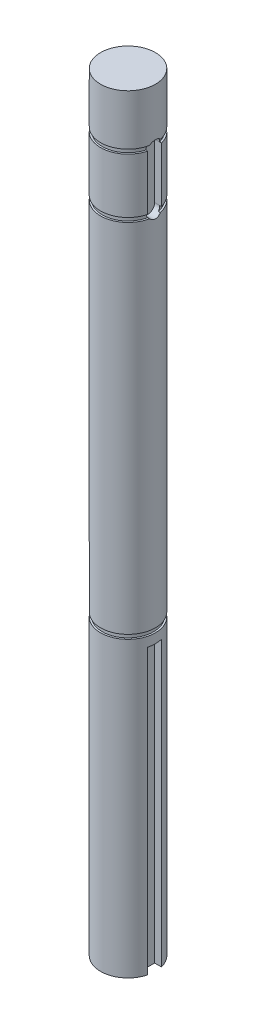
ISO-10303-21;
HEADER;
FILE_DESCRIPTION(('STEP AP214'),'2;1');
FILE_NAME('part.step','',(''),(''),'','','');
FILE_SCHEMA(('AUTOMOTIVE_DESIGN { 1 0 10303 214 1 1 1 1 }'));
ENDSEC;
DATA;
#1=APPLICATION_CONTEXT('core data for automotive mechanical design processes');
#2=APPLICATION_PROTOCOL_DEFINITION('international standard','automotive_design',2000,#1);
#3=PRODUCT_CONTEXT('',#1,'mechanical');
#4=PRODUCT('Part','Part','',(#3));
#5=PRODUCT_RELATED_PRODUCT_CATEGORY('part','',(#4));
#6=PRODUCT_DEFINITION_FORMATION('','',#4);
#7=PRODUCT_DEFINITION_CONTEXT('part definition',#1,'design');
#8=PRODUCT_DEFINITION('design','',#6,#7);
#9=PRODUCT_DEFINITION_SHAPE('','',#8);
#10=(LENGTH_UNIT() NAMED_UNIT(*) SI_UNIT(.MILLI.,.METRE.));
#11=(NAMED_UNIT(*) PLANE_ANGLE_UNIT() SI_UNIT($,.RADIAN.));
#12=(NAMED_UNIT(*) SI_UNIT($,.STERADIAN.) SOLID_ANGLE_UNIT());
#13=UNCERTAINTY_MEASURE_WITH_UNIT(LENGTH_MEASURE(1.E-05),#10,'distance_accuracy_value','');
#14=(GEOMETRIC_REPRESENTATION_CONTEXT(3) GLOBAL_UNCERTAINTY_ASSIGNED_CONTEXT((#13)) GLOBAL_UNIT_ASSIGNED_CONTEXT((#10,
#11,#12)) REPRESENTATION_CONTEXT('',''));
#15=CARTESIAN_POINT('',(0.,0.,0.));
#16=DIRECTION('',(0.,0.,1.));
#17=DIRECTION('',(1.,0.,0.));
#18=AXIS2_PLACEMENT_3D('',#15,#16,#17);
#19=CARTESIAN_POINT('',(0.,177.8,0.));
#20=DIRECTION('',(0.,-1.,0.));
#21=DIRECTION('',(0.,0.,-1.));
#22=AXIS2_PLACEMENT_3D('',#19,#20,#21);
#23=CYLINDRICAL_SURFACE('',#22,6.35);
#24=DIRECTION('',(0.,-1.,0.));
#25=VECTOR('',#24,1.);
#26=CARTESIAN_POINT('',(6.14836106210428,177.8,-1.5875));
#27=LINE('',#26,#25);
#28=CARTESIAN_POINT('',(6.14836106210428,152.4,-1.5875));
#29=VERTEX_POINT('',#28);
#30=CARTESIAN_POINT('',(6.14836106210428,165.1,-1.5875));
#31=VERTEX_POINT('',#30);
#32=EDGE_CURVE('E359',#29,#31,#27,.F.);
#33=ORIENTED_EDGE('',*,*,#32,.F.);
#34=CARTESIAN_POINT('',(0.,152.4,0.));
#35=DIRECTION('',(0.,1.,0.));
#36=DIRECTION('',(0.,0.,1.));
#37=AXIS2_PLACEMENT_3D('',#34,#35,#36);
#38=CIRCLE('',#37,6.35);
#39=CARTESIAN_POINT('',(6.14836106210428,152.4,1.5875));
#40=VERTEX_POINT('',#39);
#41=EDGE_CURVE('E324',#29,#40,#38,.T.);
#42=ORIENTED_EDGE('',*,*,#41,.T.);
#43=DIRECTION('',(0.,-1.,0.));
#44=VECTOR('',#43,1.);
#45=CARTESIAN_POINT('',(6.14836106210427,177.8,1.5875));
#46=LINE('',#45,#44);
#47=CARTESIAN_POINT('',(6.14836106210428,165.1,1.5875));
#48=VERTEX_POINT('',#47);
#49=EDGE_CURVE('E361',#40,#48,#46,.F.);
#50=ORIENTED_EDGE('',*,*,#49,.T.);
#51=CARTESIAN_POINT('',(0.,165.1,0.));
#52=DIRECTION('',(0.,-1.,0.));
#53=DIRECTION('',(0.,0.,-1.));
#54=AXIS2_PLACEMENT_3D('',#51,#52,#53);
#55=CIRCLE('',#54,6.35);
#56=EDGE_CURVE('E355',#48,#31,#55,.T.);
#57=ORIENTED_EDGE('',*,*,#56,.T.);
#58=EDGE_LOOP('',(#33,#42,#50,#57));
#59=FACE_BOUND('',#58,.T.);
#60=ADVANCED_FACE('F32',(#59),#23,.T.);
#61=CARTESIAN_POINT('',(0.,165.1,44.9225171601781));
#62=DIRECTION('',(0.,-1.,0.));
#63=DIRECTION('',(0.,0.,-1.));
#64=AXIS2_PLACEMENT_3D('',#61,#62,#63);
#65=PLANE('',#64);
#66=DIRECTION('',(1.,0.,0.));
#67=VECTOR('',#66,1.);
#68=CARTESIAN_POINT('',(4.572,165.1,-1.5875));
#69=LINE('',#68,#67);
#70=CARTESIAN_POINT('',(5.72767184028555,165.1,-1.5875));
#71=VERTEX_POINT('',#70);
#72=EDGE_CURVE('E176',#71,#31,#69,.T.);
#73=ORIENTED_EDGE('',*,*,#72,.T.);
#74=ORIENTED_EDGE('',*,*,#56,.F.);
#75=DIRECTION('',(1.,0.,0.));
#76=VECTOR('',#75,1.);
#77=CARTESIAN_POINT('',(4.572,165.1,1.5875));
#78=LINE('',#77,#76);
#79=CARTESIAN_POINT('',(5.72767184028555,165.1,1.5875));
#80=VERTEX_POINT('',#79);
#81=EDGE_CURVE('E172',#80,#48,#78,.T.);
#82=ORIENTED_EDGE('',*,*,#81,.F.);
#83=CARTESIAN_POINT('',(0.,165.1,0.));
#84=DIRECTION('',(0.,1.,0.));
#85=DIRECTION('',(0.,0.,1.));
#86=AXIS2_PLACEMENT_3D('',#83,#84,#85);
#87=CIRCLE('',#86,5.9436);
#88=EDGE_CURVE('E327',#71,#80,#87,.T.);
#89=ORIENTED_EDGE('',*,*,#88,.F.);
#90=EDGE_LOOP('',(#73,#74,#82,#89));
#91=FACE_BOUND('',#90,.T.);
#92=ADVANCED_FACE('F273',(#91),#65,.F.);
#93=CARTESIAN_POINT('',(0.,166.0906,44.9225171601781));
#94=DIRECTION('',(0.,1.,0.));
#95=DIRECTION('',(0.,0.,1.));
#96=AXIS2_PLACEMENT_3D('',#93,#94,#95);
#97=PLANE('',#96);
#98=CARTESIAN_POINT('',(0.,166.0906,0.));
#99=DIRECTION('',(0.,1.,0.));
#100=DIRECTION('',(0.,0.,1.));
#101=AXIS2_PLACEMENT_3D('',#98,#99,#100);
#102=CIRCLE('',#101,5.9436);
#103=CARTESIAN_POINT('',(5.81270273366874,166.0906,-1.24051114061905));
#104=VERTEX_POINT('',#103);
#105=CARTESIAN_POINT('',(5.81270273366874,166.0906,1.24051114061905));
#106=VERTEX_POINT('',#105);
#107=EDGE_CURVE('E323',#104,#106,#102,.T.);
#108=ORIENTED_EDGE('',*,*,#107,.T.);
#109=DIRECTION('',(1.,0.,0.));
#110=VECTOR('',#109,1.);
#111=CARTESIAN_POINT('',(4.572,166.0906,1.24051114061905));
#112=LINE('',#111,#110);
#113=CARTESIAN_POINT('',(6.22765060917839,166.0906,1.24051114061905));
#114=VERTEX_POINT('',#113);
#115=EDGE_CURVE('E259',#106,#114,#112,.T.);
#116=ORIENTED_EDGE('',*,*,#115,.T.);
#117=CARTESIAN_POINT('',(0.,166.0906,0.));
#118=DIRECTION('',(0.,1.,0.));
#119=DIRECTION('',(0.,0.,1.));
#120=AXIS2_PLACEMENT_3D('',#117,#118,#119);
#121=CIRCLE('',#120,6.35);
#122=CARTESIAN_POINT('',(6.22765060917839,166.0906,-1.24051114061905));
#123=VERTEX_POINT('',#122);
#124=EDGE_CURVE('E349',#123,#114,#121,.T.);
#125=ORIENTED_EDGE('',*,*,#124,.F.);
#126=DIRECTION('',(1.,0.,0.));
#127=VECTOR('',#126,1.);
#128=CARTESIAN_POINT('',(4.572,166.0906,-1.24051114061905));
#129=LINE('',#128,#127);
#130=EDGE_CURVE('E374',#123,#104,#129,.F.);
#131=ORIENTED_EDGE('',*,*,#130,.T.);
#132=EDGE_LOOP('',(#108,#116,#125,#131));
#133=FACE_BOUND('',#132,.T.);
#134=ADVANCED_FACE('F271',(#133),#97,.F.);
#135=CARTESIAN_POINT('',(0.,174.664052397494,0.));
#136=DIRECTION('',(0.,1.,0.));
#137=DIRECTION('',(0.,0.,1.));
#138=AXIS2_PLACEMENT_3D('',#135,#136,#137);
#139=CYLINDRICAL_SURFACE('',#138,5.9436);
#140=ORIENTED_EDGE('',*,*,#88,.T.);
#141=CARTESIAN_POINT('',(5.72767184028555,165.1,1.5875));
#142=CARTESIAN_POINT('',(5.72766804610027,165.144378886621,1.58750194805808));
#143=CARTESIAN_POINT('',(5.72818813422054,165.188738268631,1.58563830137082));
#144=CARTESIAN_POINT('',(5.73024000478097,165.277112391909,1.57821195212509));
#145=CARTESIAN_POINT('',(5.73177154850907,165.321127212017,1.57265012236694));
#146=CARTESIAN_POINT('',(5.73771384551916,165.449721720951,1.55088835422927));
#147=CARTESIAN_POINT('',(5.74347777277273,165.533428951732,1.52960258418085));
#148=CARTESIAN_POINT('',(5.75836292111803,165.699748178597,1.47259415694831));
#149=CARTESIAN_POINT('',(5.76762462415825,165.782138097461,1.43626019797557));
#150=CARTESIAN_POINT('',(5.78329806159334,165.901208771875,1.37126100174845));
#151=CARTESIAN_POINT('',(5.78891663315769,165.940696065829,1.34740876355261));
#152=CARTESIAN_POINT('',(5.80055334186276,166.017403891367,1.29639711833931));
#153=CARTESIAN_POINT('',(5.80657142646175,166.054624719794,1.26923814581491));
#154=CARTESIAN_POINT('',(5.81270273366874,166.0906,1.24051114061906));
#155=B_SPLINE_CURVE_WITH_KNOTS('',3,(#141,#142,#143,#144,#145,#146,#147,#148,#149,#150,#151,
#152,#153,#154),.UNSPECIFIED.,.F.,.F.,(4,2,2,2,2,2,4),(0.,0.133056350009766,0.266081308813876,
0.524501760701669,0.794649138064694,0.933915485774906,1.07316355409294),.UNSPECIFIED.);
#156=EDGE_CURVE('E258',#80,#106,#155,.T.);
#157=ORIENTED_EDGE('',*,*,#156,.T.);
#158=ORIENTED_EDGE('',*,*,#107,.F.);
#159=CARTESIAN_POINT('',(5.81270273366874,166.0906,-1.24051114061905));
#160=CARTESIAN_POINT('',(5.80676093223229,166.05573733761,-1.26835031027518));
#161=CARTESIAN_POINT('',(5.8009253407225,166.019703297245,-1.29471734166641));
#162=CARTESIAN_POINT('',(5.78962448943313,165.945501088542,-1.34435038702207));
#163=CARTESIAN_POINT('',(5.78415925642407,165.907332766294,-1.36761617693748));
#164=CARTESIAN_POINT('',(5.76886044428707,165.792228140253,-1.43125963250242));
#165=CARTESIAN_POINT('',(5.75975979338478,165.712631861975,-1.46711930717737));
#166=CARTESIAN_POINT('',(5.74448324543573,165.546948397418,-1.52585859113951));
#167=CARTESIAN_POINT('',(5.73835992335598,165.460773607262,-1.54850619216326));
#168=CARTESIAN_POINT('',(5.73203917642506,165.328229697473,-1.57167662157916));
#169=CARTESIAN_POINT('',(5.73040804690453,165.282814755494,-1.57760264372825));
#170=CARTESIAN_POINT('',(5.72822216727329,165.191607436818,-1.58551566901053));
#171=CARTESIAN_POINT('',(5.72766765395878,165.145814979314,-1.58750180558823));
#172=CARTESIAN_POINT('',(5.72767184028554,165.1,-1.5875));
#173=B_SPLINE_CURVE_WITH_KNOTS('',3,(#159,#160,#161,#162,#163,#164,#165,#166,#167,#168,#169,
#170,#171,#172),.UNSPECIFIED.,.F.,.F.,(4,2,2,2,2,2,4),(0.,0.134949650076808,0.26990904430555,
0.531960547427962,0.798485077464061,0.935809383428468,1.07316388974744),.UNSPECIFIED.);
#174=EDGE_CURVE('E251',#104,#71,#173,.T.);
#175=ORIENTED_EDGE('',*,*,#174,.T.);
#176=EDGE_LOOP('',(#140,#157,#158,#175));
#177=FACE_BOUND('',#176,.T.);
#178=ADVANCED_FACE('F265',(#177),#139,.T.);
#179=CARTESIAN_POINT('',(0.,177.8,0.));
#180=DIRECTION('',(0.,1.,0.));
#181=DIRECTION('',(0.,0.,1.));
#182=AXIS2_PLACEMENT_3D('',#179,#180,#181);
#183=PLANE('',#182);
#184=CARTESIAN_POINT('',(0.,177.8,0.));
#185=DIRECTION('',(0.,1.,0.));
#186=DIRECTION('',(0.,0.,1.));
#187=AXIS2_PLACEMENT_3D('',#184,#185,#186);
#188=CIRCLE('',#187,6.35);
#189=CARTESIAN_POINT('',(0.,177.8,6.35));
#190=VERTEX_POINT('',#189);
#191=EDGE_CURVE('E229',#190,#190,#188,.T.);
#192=ORIENTED_EDGE('',*,*,#191,.T.);
#193=EDGE_LOOP('',(#192));
#194=FACE_BOUND('',#193,.T.);
#195=ADVANCED_FACE('F270',(#194),#183,.T.);
#196=ORIENTED_EDGE('',*,*,#124,.T.);
#197=CARTESIAN_POINT('',(6.22765060917839,166.0906,1.24051114061905));
#198=CARTESIAN_POINT('',(6.23320783945382,166.125537821559,1.21261023935729));
#199=CARTESIAN_POINT('',(6.23886039060933,166.159271263635,1.18325559981258));
#200=CARTESIAN_POINT('',(6.25020149422038,166.224141606585,1.12181126216661));
#201=CARTESIAN_POINT('',(6.25589004691655,166.255278490084,1.08972154576645));
#202=CARTESIAN_POINT('',(6.2727722846694,166.344483709908,0.989640681923253));
#203=CARTESIAN_POINT('',(6.28378811857192,166.398380138224,0.917811004237591));
#204=CARTESIAN_POINT('',(6.3041083179383,166.493415120787,0.765894226562197));
#205=CARTESIAN_POINT('',(6.31341126157691,166.53454309553,0.685800351954504));
#206=CARTESIAN_POINT('',(6.32925406928647,166.602736538024,0.519609689028033));
#207=CARTESIAN_POINT('',(6.33579564411445,166.629810714952,0.433516656017851));
#208=CARTESIAN_POINT('',(6.34529454604823,166.668684630818,0.259270320083087));
#209=CARTESIAN_POINT('',(6.34830987825245,166.680731784918,0.171175393891085));
#210=CARTESIAN_POINT('',(6.35061397512241,166.689960889227,-0.00584854805472702));
#211=CARTESIAN_POINT('',(6.34990259861924,166.687142276315,-0.0947775952779285));
#212=CARTESIAN_POINT('',(6.34488868818956,166.666958390865,-0.268922050286349));
#213=CARTESIAN_POINT('',(6.34066327595629,166.649905485485,-0.354176205390162));
#214=CARTESIAN_POINT('',(6.32917385599744,166.602208199794,-0.520596366331567));
#215=CARTESIAN_POINT('',(6.32190904766935,166.571560238303,-0.601761288714845));
#216=CARTESIAN_POINT('',(6.30501409455029,166.497204850677,-0.758684558613007));
#217=CARTESIAN_POINT('',(6.2953588178793,166.45335752252,-0.834373638215728));
#218=CARTESIAN_POINT('',(6.27474734999086,166.353977147904,-0.977374398357565));
#219=CARTESIAN_POINT('',(6.26379263841329,166.29845733804,-1.04469543181984));
#220=CARTESIAN_POINT('',(6.24855866645397,166.214746637295,-1.13075323727131));
#221=CARTESIAN_POINT('',(6.24433654135724,166.19086298298,-1.15381013700282));
#222=CARTESIAN_POINT('',(6.23594250238016,166.141738716093,-1.19834525875781));
#223=CARTESIAN_POINT('',(6.2317705110774,166.116500653265,-1.2198262786031));
#224=CARTESIAN_POINT('',(6.22765060917839,166.0906,-1.24051114061905));
#225=B_SPLINE_CURVE_WITH_KNOTS('',3,(#197,#198,#199,#200,#201,#202,#203,#204,#205,#206,#207,
#208,#209,#210,#211,#212,#213,#214,#215,#216,#217,#218,#219,#220,#221,#222,#223,#224),
.UNSPECIFIED.,.F.,.F.,(4,2,2,2,2,2,2,2,2,2,2,2,2,4),(0.,0.1350832839213,0.270167471681572,
0.540207610771838,0.810470902383498,1.08056651055363,1.34615372554161,1.61175100112947,
1.87166851811818,2.13165454271633,2.39449949657431,2.65704797661505,2.7573913521589,
2.85755203549018),.UNSPECIFIED.);
#226=EDGE_CURVE('E228',#114,#123,#225,.T.);
#227=ORIENTED_EDGE('',*,*,#226,.T.);
#228=EDGE_LOOP('',(#196,#227));
#229=FACE_BOUND('',#228,.T.);
#230=ORIENTED_EDGE('',*,*,#191,.F.);
#231=EDGE_LOOP('',(#230));
#232=FACE_BOUND('',#231,.T.);
#233=ADVANCED_FACE('F34',(#229,#232),#23,.T.);
#234=CARTESIAN_POINT('',(0.,151.4094,32.0705297304296));
#235=DIRECTION('',(0.,-1.,0.));
#236=DIRECTION('',(0.,0.,-1.));
#237=AXIS2_PLACEMENT_3D('',#234,#235,#236);
#238=PLANE('',#237);
#239=CARTESIAN_POINT('',(0.,151.4094,0.));
#240=DIRECTION('',(0.,1.,0.));
#241=DIRECTION('',(0.,0.,1.));
#242=AXIS2_PLACEMENT_3D('',#239,#240,#241);
#243=CIRCLE('',#242,5.9436);
#244=CARTESIAN_POINT('',(5.81270273366874,151.4094,-1.24051114061905));
#245=VERTEX_POINT('',#244);
#246=CARTESIAN_POINT('',(5.81270273366874,151.4094,1.24051114061905));
#247=VERTEX_POINT('',#246);
#248=EDGE_CURVE('E330',#245,#247,#243,.T.);
#249=ORIENTED_EDGE('',*,*,#248,.F.);
#250=DIRECTION('',(1.,0.,0.));
#251=VECTOR('',#250,1.);
#252=CARTESIAN_POINT('',(4.572,151.4094,-1.24051114061905));
#253=LINE('',#252,#251);
#254=CARTESIAN_POINT('',(6.22765060917839,151.4094,-1.24051114061905));
#255=VERTEX_POINT('',#254);
#256=EDGE_CURVE('E189',#245,#255,#253,.T.);
#257=ORIENTED_EDGE('',*,*,#256,.T.);
#258=CARTESIAN_POINT('',(0.,151.4094,0.));
#259=DIRECTION('',(0.,-1.,0.));
#260=DIRECTION('',(0.,0.,-1.));
#261=AXIS2_PLACEMENT_3D('',#258,#259,#260);
#262=CIRCLE('',#261,6.35);
#263=CARTESIAN_POINT('',(6.22765060917839,151.4094,1.24051114061905));
#264=VERTEX_POINT('',#263);
#265=EDGE_CURVE('E322',#264,#255,#262,.T.);
#266=ORIENTED_EDGE('',*,*,#265,.F.);
#267=DIRECTION('',(1.,0.,0.));
#268=VECTOR('',#267,1.);
#269=CARTESIAN_POINT('',(4.572,151.4094,1.24051114061905));
#270=LINE('',#269,#268);
#271=EDGE_CURVE('E56',#264,#247,#270,.F.);
#272=ORIENTED_EDGE('',*,*,#271,.T.);
#273=EDGE_LOOP('',(#249,#257,#266,#272));
#274=FACE_BOUND('',#273,.T.);
#275=ADVANCED_FACE('F297',(#274),#238,.F.);
#276=CARTESIAN_POINT('',(0.,152.4,32.0705297304296));
#277=DIRECTION('',(0.,1.,0.));
#278=DIRECTION('',(0.,0.,1.));
#279=AXIS2_PLACEMENT_3D('',#276,#277,#278);
#280=PLANE('',#279);
#281=ORIENTED_EDGE('',*,*,#41,.F.);
#282=DIRECTION('',(1.,0.,0.));
#283=VECTOR('',#282,1.);
#284=CARTESIAN_POINT('',(4.572,152.4,-1.5875));
#285=LINE('',#284,#283);
#286=CARTESIAN_POINT('',(5.72767184028555,152.4,-1.5875));
#287=VERTEX_POINT('',#286);
#288=EDGE_CURVE('E180',#287,#29,#285,.T.);
#289=ORIENTED_EDGE('',*,*,#288,.F.);
#290=CARTESIAN_POINT('',(0.,152.4,0.));
#291=DIRECTION('',(0.,1.,0.));
#292=DIRECTION('',(0.,0.,1.));
#293=AXIS2_PLACEMENT_3D('',#290,#291,#292);
#294=CIRCLE('',#293,5.9436);
#295=CARTESIAN_POINT('',(5.72767184028555,152.4,1.5875));
#296=VERTEX_POINT('',#295);
#297=EDGE_CURVE('E335',#287,#296,#294,.T.);
#298=ORIENTED_EDGE('',*,*,#297,.T.);
#299=DIRECTION('',(1.,0.,0.));
#300=VECTOR('',#299,1.);
#301=CARTESIAN_POINT('',(4.572,152.4,1.5875));
#302=LINE('',#301,#300);
#303=EDGE_CURVE('E184',#296,#40,#302,.T.);
#304=ORIENTED_EDGE('',*,*,#303,.T.);
#305=EDGE_LOOP('',(#281,#289,#298,#304));
#306=FACE_BOUND('',#305,.T.);
#307=ADVANCED_FACE('F302',(#306),#280,.F.);
#308=CARTESIAN_POINT('',(0.,162.01391125863,0.));
#309=DIRECTION('',(0.,1.,0.));
#310=DIRECTION('',(0.,0.,1.));
#311=AXIS2_PLACEMENT_3D('',#308,#309,#310);
#312=CYLINDRICAL_SURFACE('',#311,5.9436);
#313=ORIENTED_EDGE('',*,*,#248,.T.);
#314=CARTESIAN_POINT('',(5.81270273366874,151.4094,1.24051114061905));
#315=CARTESIAN_POINT('',(5.80676093223229,151.44426266239,1.26835031027518));
#316=CARTESIAN_POINT('',(5.8009253407225,151.480296702754,1.29471734166641));
#317=CARTESIAN_POINT('',(5.78962448943313,151.554498911458,1.34435038702207));
#318=CARTESIAN_POINT('',(5.78415925642407,151.592667233706,1.36761617693748));
#319=CARTESIAN_POINT('',(5.76886044428707,151.707771859747,1.43125963250242));
#320=CARTESIAN_POINT('',(5.75975979338478,151.787368138025,1.46711930717737));
#321=CARTESIAN_POINT('',(5.74448324543573,151.953051602581,1.52585859113951));
#322=CARTESIAN_POINT('',(5.73835992335598,152.039226392738,1.54850619216326));
#323=CARTESIAN_POINT('',(5.73203917642506,152.171770302527,1.57167662157916));
#324=CARTESIAN_POINT('',(5.73040804690453,152.217185244506,1.57760264372825));
#325=CARTESIAN_POINT('',(5.72822216727329,152.308392563182,1.58551566901053));
#326=CARTESIAN_POINT('',(5.72766765395878,152.354185020686,1.58750180558823));
#327=CARTESIAN_POINT('',(5.72767184028554,152.4,1.5875));
#328=B_SPLINE_CURVE_WITH_KNOTS('',3,(#314,#315,#316,#317,#318,#319,#320,#321,#322,#323,#324,
#325,#326,#327),.UNSPECIFIED.,.F.,.F.,(4,2,2,2,2,2,4),(0.,0.134949650076808,0.26990904430555,
0.531960547427962,0.798485077464061,0.935809383428468,1.07316388974744),.UNSPECIFIED.);
#329=EDGE_CURVE('E200',#247,#296,#328,.T.);
#330=ORIENTED_EDGE('',*,*,#329,.T.);
#331=ORIENTED_EDGE('',*,*,#297,.F.);
#332=CARTESIAN_POINT('',(5.72767184028555,152.4,-1.5875));
#333=CARTESIAN_POINT('',(5.72766804610027,152.355621113379,-1.58750194805808));
#334=CARTESIAN_POINT('',(5.72818813422054,152.311261731369,-1.58563830137082));
#335=CARTESIAN_POINT('',(5.73024000478097,152.222887608091,-1.57821195212509));
#336=CARTESIAN_POINT('',(5.73177154850907,152.178872787983,-1.57265012236694));
#337=CARTESIAN_POINT('',(5.73771384551916,152.050278279048,-1.55088835422927));
#338=CARTESIAN_POINT('',(5.74347777277273,151.966571048268,-1.52960258418085));
#339=CARTESIAN_POINT('',(5.75836292111803,151.800251821403,-1.47259415694831));
#340=CARTESIAN_POINT('',(5.76762462415825,151.717861902539,-1.43626019797557));
#341=CARTESIAN_POINT('',(5.78329806159334,151.598791228125,-1.37126100174845));
#342=CARTESIAN_POINT('',(5.78891663315768,151.559303934171,-1.34740876355262));
#343=CARTESIAN_POINT('',(5.80055334186276,151.482596108633,-1.29639711833931));
#344=CARTESIAN_POINT('',(5.80657142646175,151.445375280206,-1.26923814581491));
#345=CARTESIAN_POINT('',(5.81270273366874,151.4094,-1.24051114061906));
#346=B_SPLINE_CURVE_WITH_KNOTS('',3,(#332,#333,#334,#335,#336,#337,#338,#339,#340,#341,#342,
#343,#344,#345),.UNSPECIFIED.,.F.,.F.,(4,2,2,2,2,2,4),(0.,0.133056350009766,0.266081308813876,
0.524501760701669,0.794649138064694,0.933915485774875,1.07316355409294),.UNSPECIFIED.);
#347=EDGE_CURVE('E192',#287,#245,#346,.T.);
#348=ORIENTED_EDGE('',*,*,#347,.T.);
#349=EDGE_LOOP('',(#313,#330,#331,#348));
#350=FACE_BOUND('',#349,.T.);
#351=ADVANCED_FACE('F205',(#350),#312,.T.);
#352=CARTESIAN_POINT('',(0.,68.8594,0.));
#353=DIRECTION('',(0.,1.,0.));
#354=DIRECTION('',(0.,0.,1.));
#355=AXIS2_PLACEMENT_3D('',#352,#353,#354);
#356=CIRCLE('',#355,6.35);
#357=CARTESIAN_POINT('',(0.,68.8594,6.35));
#358=VERTEX_POINT('',#357);
#359=EDGE_CURVE('E319',#358,#358,#356,.T.);
#360=ORIENTED_EDGE('',*,*,#359,.T.);
#361=EDGE_LOOP('',(#360));
#362=FACE_BOUND('',#361,.T.);
#363=ORIENTED_EDGE('',*,*,#265,.T.);
#364=CARTESIAN_POINT('',(6.22765060917839,151.4094,-1.24051114061905));
#365=CARTESIAN_POINT('',(6.23320783945382,151.374462178441,-1.21261023935729));
#366=CARTESIAN_POINT('',(6.23886039060933,151.340728736365,-1.18325559981258));
#367=CARTESIAN_POINT('',(6.25020149422038,151.275858393415,-1.12181126216661));
#368=CARTESIAN_POINT('',(6.25589004691655,151.244721509916,-1.08972154576645));
#369=CARTESIAN_POINT('',(6.2727722846694,151.155516290092,-0.989640681923253));
#370=CARTESIAN_POINT('',(6.28378811857192,151.101619861776,-0.917811004237591));
#371=CARTESIAN_POINT('',(6.3041083179383,151.006584879213,-0.765894226562197));
#372=CARTESIAN_POINT('',(6.31341126157691,150.96545690447,-0.685800351954504));
#373=CARTESIAN_POINT('',(6.32925406928647,150.897263461976,-0.519609689028033));
#374=CARTESIAN_POINT('',(6.33579564411445,150.870189285048,-0.433516656017851));
#375=CARTESIAN_POINT('',(6.34529454604823,150.831315369182,-0.259270320083087));
#376=CARTESIAN_POINT('',(6.34830987825245,150.819268215081,-0.171175393891085));
#377=CARTESIAN_POINT('',(6.35061397512241,150.810039110773,0.00584854805472706));
#378=CARTESIAN_POINT('',(6.34990259861924,150.812857723685,0.0947775952779287));
#379=CARTESIAN_POINT('',(6.34488868818956,150.833041609135,0.268922050286349));
#380=CARTESIAN_POINT('',(6.34066327595629,150.850094514515,0.354176205390161));
#381=CARTESIAN_POINT('',(6.32917385599744,150.897791800206,0.520596366331567));
#382=CARTESIAN_POINT('',(6.32190904766935,150.928439761697,0.601761288714847));
#383=CARTESIAN_POINT('',(6.30501409455029,151.002795149323,0.758684558613013));
#384=CARTESIAN_POINT('',(6.2953588178793,151.04664247748,0.834373638215735));
#385=CARTESIAN_POINT('',(6.27474734999086,151.146022852096,0.97737439835757));
#386=CARTESIAN_POINT('',(6.26379263841329,151.20154266196,1.04469543181984));
#387=CARTESIAN_POINT('',(6.24855866645397,151.285253362705,1.13075323727131));
#388=CARTESIAN_POINT('',(6.24433654135724,151.30913701702,1.15381013700282));
#389=CARTESIAN_POINT('',(6.23594250238016,151.358261283907,1.19834525875781));
#390=CARTESIAN_POINT('',(6.23177051107741,151.383499346735,1.2198262786031));
#391=CARTESIAN_POINT('',(6.22765060917839,151.4094,1.24051114061905));
#392=B_SPLINE_CURVE_WITH_KNOTS('',3,(#364,#365,#366,#367,#368,#369,#370,#371,#372,#373,#374,
#375,#376,#377,#378,#379,#380,#381,#382,#383,#384,#385,#386,#387,#388,#389,#390,#391),
.UNSPECIFIED.,.F.,.F.,(4,2,2,2,2,2,2,2,2,2,2,2,2,4),(0.,0.1350832839213,0.270167471681572,
0.540207610771838,0.810470902383498,1.08056651055363,1.34615372554161,1.61175100112947,
1.87166851811818,2.13165454271633,2.39449949657433,2.65704797661505,2.7573913521589,
2.85755203549018),.UNSPECIFIED.);
#393=EDGE_CURVE('E222',#255,#264,#392,.T.);
#394=ORIENTED_EDGE('',*,*,#393,.T.);
#395=EDGE_LOOP('',(#363,#394));
#396=FACE_BOUND('',#395,.T.);
#397=ADVANCED_FACE('F289',(#362,#396),#23,.T.);
#398=CARTESIAN_POINT('',(0.,67.8688,51.9936808646007));
#399=DIRECTION('',(0.,-1.,0.));
#400=DIRECTION('',(0.,0.,-1.));
#401=AXIS2_PLACEMENT_3D('',#398,#399,#400);
#402=PLANE('',#401);
#403=CARTESIAN_POINT('',(0.,67.8688,0.));
#404=DIRECTION('',(0.,1.,0.));
#405=DIRECTION('',(0.,0.,1.));
#406=AXIS2_PLACEMENT_3D('',#403,#404,#405);
#407=CIRCLE('',#406,5.9436);
#408=CARTESIAN_POINT('',(0.,67.8688,5.9436));
#409=VERTEX_POINT('',#408);
#410=EDGE_CURVE('E333',#409,#409,#407,.T.);
#411=ORIENTED_EDGE('',*,*,#410,.F.);
#412=EDGE_LOOP('',(#411));
#413=FACE_BOUND('',#412,.T.);
#414=CARTESIAN_POINT('',(0.,67.8688,0.));
#415=DIRECTION('',(0.,-1.,0.));
#416=DIRECTION('',(0.,0.,-1.));
#417=AXIS2_PLACEMENT_3D('',#414,#415,#416);
#418=CIRCLE('',#417,6.35);
#419=CARTESIAN_POINT('',(0.,67.8688,-6.35));
#420=VERTEX_POINT('',#419);
#421=EDGE_CURVE('E230',#420,#420,#418,.T.);
#422=ORIENTED_EDGE('',*,*,#421,.F.);
#423=EDGE_LOOP('',(#422));
#424=FACE_BOUND('',#423,.T.);
#425=ADVANCED_FACE('F307',(#413,#424),#402,.F.);
#426=CARTESIAN_POINT('',(0.,68.8594,51.9936808646007));
#427=DIRECTION('',(0.,1.,0.));
#428=DIRECTION('',(0.,0.,1.));
#429=AXIS2_PLACEMENT_3D('',#426,#427,#428);
#430=PLANE('',#429);
#431=CARTESIAN_POINT('',(0.,68.8594,0.));
#432=DIRECTION('',(0.,1.,0.));
#433=DIRECTION('',(0.,0.,1.));
#434=AXIS2_PLACEMENT_3D('',#431,#432,#433);
#435=CIRCLE('',#434,5.9436);
#436=CARTESIAN_POINT('',(0.,68.8594,5.9436));
#437=VERTEX_POINT('',#436);
#438=EDGE_CURVE('E337',#437,#437,#435,.T.);
#439=ORIENTED_EDGE('',*,*,#438,.T.);
#440=EDGE_LOOP('',(#439));
#441=FACE_BOUND('',#440,.T.);
#442=ORIENTED_EDGE('',*,*,#359,.F.);
#443=EDGE_LOOP('',(#442));
#444=FACE_BOUND('',#443,.T.);
#445=ADVANCED_FACE('F245',(#441,#444),#430,.F.);
#446=CARTESIAN_POINT('',(0.,70.2953556434186,0.));
#447=DIRECTION('',(0.,1.,0.));
#448=DIRECTION('',(0.,0.,1.));
#449=AXIS2_PLACEMENT_3D('',#446,#447,#448);
#450=CYLINDRICAL_SURFACE('',#449,5.9436);
#451=ORIENTED_EDGE('',*,*,#438,.F.);
#452=EDGE_LOOP('',(#451));
#453=FACE_BOUND('',#452,.T.);
#454=ORIENTED_EDGE('',*,*,#410,.T.);
#455=EDGE_LOOP('',(#454));
#456=FACE_BOUND('',#455,.T.);
#457=ADVANCED_FACE('F282',(#453,#456),#450,.T.);
#458=CARTESIAN_POINT('',(0.,0.,0.));
#459=DIRECTION('',(0.,1.,0.));
#460=DIRECTION('',(0.,0.,1.));
#461=AXIS2_PLACEMENT_3D('',#458,#459,#460);
#462=PLANE('',#461);
#463=DIRECTION('',(0.,0.,-1.));
#464=VECTOR('',#463,1.);
#465=CARTESIAN_POINT('',(4.572,0.,0.));
#466=LINE('',#465,#464);
#467=CARTESIAN_POINT('',(4.572,0.,1.58749999999999));
#468=VERTEX_POINT('',#467);
#469=CARTESIAN_POINT('',(4.572,0.,-1.58750000000001));
#470=VERTEX_POINT('',#469);
#471=EDGE_CURVE('E11',#468,#470,#466,.T.);
#472=ORIENTED_EDGE('',*,*,#471,.F.);
#473=DIRECTION('',(1.,0.,0.));
#474=VECTOR('',#473,1.);
#475=CARTESIAN_POINT('',(0.,0.,1.58749999999999));
#476=LINE('',#475,#474);
#477=CARTESIAN_POINT('',(6.14836106210427,0.,1.58750000000001));
#478=VERTEX_POINT('',#477);
#479=EDGE_CURVE('E158',#468,#478,#476,.T.);
#480=ORIENTED_EDGE('',*,*,#479,.T.);
#481=CARTESIAN_POINT('',(0.,0.,0.));
#482=DIRECTION('',(0.,1.,0.));
#483=DIRECTION('',(0.,0.,1.));
#484=AXIS2_PLACEMENT_3D('',#481,#482,#483);
#485=CIRCLE('',#484,6.35);
#486=CARTESIAN_POINT('',(6.14836106210428,0.,-1.58749999999999));
#487=VERTEX_POINT('',#486);
#488=EDGE_CURVE('E352',#487,#478,#485,.T.);
#489=ORIENTED_EDGE('',*,*,#488,.F.);
#490=DIRECTION('',(-1.,0.,0.));
#491=VECTOR('',#490,1.);
#492=CARTESIAN_POINT('',(0.,0.,-1.58750000000001));
#493=LINE('',#492,#491);
#494=EDGE_CURVE('E48',#487,#470,#493,.T.);
#495=ORIENTED_EDGE('',*,*,#494,.T.);
#496=EDGE_LOOP('',(#472,#480,#489,#495));
#497=FACE_BOUND('',#496,.T.);
#498=ADVANCED_FACE('F280',(#497),#462,.F.);
#499=ORIENTED_EDGE('',*,*,#421,.T.);
#500=EDGE_LOOP('',(#499));
#501=FACE_BOUND('',#500,.T.);
#502=ORIENTED_EDGE('',*,*,#488,.T.);
#503=DIRECTION('',(0.,-1.,0.));
#504=VECTOR('',#503,1.);
#505=CARTESIAN_POINT('',(6.14836106210427,177.8,1.58750000000001));
#506=LINE('',#505,#504);
#507=CARTESIAN_POINT('',(6.14836106210427,65.6844,1.5875));
#508=VERTEX_POINT('',#507);
#509=EDGE_CURVE('E41',#478,#508,#506,.F.);
#510=ORIENTED_EDGE('',*,*,#509,.T.);
#511=CARTESIAN_POINT('',(0.,65.6844,0.));
#512=DIRECTION('',(0.,1.,0.));
#513=DIRECTION('',(0.,0.,1.));
#514=AXIS2_PLACEMENT_3D('',#511,#512,#513);
#515=CIRCLE('',#514,6.35);
#516=CARTESIAN_POINT('',(6.14836106210428,65.6844,-1.5875));
#517=VERTEX_POINT('',#516);
#518=EDGE_CURVE('E237',#508,#517,#515,.T.);
#519=ORIENTED_EDGE('',*,*,#518,.T.);
#520=DIRECTION('',(0.,-1.,0.));
#521=VECTOR('',#520,1.);
#522=CARTESIAN_POINT('',(6.14836106210428,177.8,-1.58749999999999));
#523=LINE('',#522,#521);
#524=EDGE_CURVE('E145',#517,#487,#523,.T.);
#525=ORIENTED_EDGE('',*,*,#524,.T.);
#526=EDGE_LOOP('',(#502,#510,#519,#525));
#527=FACE_BOUND('',#526,.T.);
#528=ADVANCED_FACE('F243',(#501,#527),#23,.T.);
#529=CARTESIAN_POINT('',(4.572,165.1,0.));
#530=DIRECTION('',(1.,0.,0.));
#531=DIRECTION('',(0.,0.,-1.));
#532=AXIS2_PLACEMENT_3D('',#529,#530,#531);
#533=CYLINDRICAL_SURFACE('',#532,1.5875);
#534=CARTESIAN_POINT('',(4.572,165.1,1.5875));
#535=VERTEX_POINT('',#534);
#536=EDGE_CURVE('E185',#535,#80,#78,.T.);
#537=ORIENTED_EDGE('',*,*,#536,.F.);
#538=CARTESIAN_POINT('',(4.572,165.1,0.));
#539=DIRECTION('',(1.,0.,0.));
#540=DIRECTION('',(0.,0.,-1.));
#541=AXIS2_PLACEMENT_3D('',#538,#539,#540);
#542=CIRCLE('',#541,1.5875);
#543=CARTESIAN_POINT('',(4.572,165.1,-1.5875));
#544=VERTEX_POINT('',#543);
#545=EDGE_CURVE('E161',#544,#535,#542,.T.);
#546=ORIENTED_EDGE('',*,*,#545,.F.);
#547=EDGE_CURVE('E173',#544,#71,#69,.T.);
#548=ORIENTED_EDGE('',*,*,#547,.T.);
#549=ORIENTED_EDGE('',*,*,#174,.F.);
#550=ORIENTED_EDGE('',*,*,#130,.F.);
#551=ORIENTED_EDGE('',*,*,#226,.F.);
#552=ORIENTED_EDGE('',*,*,#115,.F.);
#553=ORIENTED_EDGE('',*,*,#156,.F.);
#554=EDGE_LOOP('',(#537,#546,#548,#549,#550,#551,#552,#553));
#555=FACE_BOUND('',#554,.T.);
#556=ADVANCED_FACE('F239',(#555),#533,.F.);
#557=CARTESIAN_POINT('',(4.572,165.1,-1.5875));
#558=DIRECTION('',(0.,0.,1.));
#559=DIRECTION('',(0.,-1.,0.));
#560=AXIS2_PLACEMENT_3D('',#557,#558,#559);
#561=PLANE('',#560);
#562=ORIENTED_EDGE('',*,*,#32,.T.);
#563=ORIENTED_EDGE('',*,*,#72,.F.);
#564=ORIENTED_EDGE('',*,*,#547,.F.);
#565=DIRECTION('',(0.,-1.,0.));
#566=VECTOR('',#565,1.);
#567=CARTESIAN_POINT('',(4.572,165.1,-1.5875));
#568=LINE('',#567,#566);
#569=CARTESIAN_POINT('',(4.572,152.4,-1.5875));
#570=VERTEX_POINT('',#569);
#571=EDGE_CURVE('E170',#544,#570,#568,.T.);
#572=ORIENTED_EDGE('',*,*,#571,.T.);
#573=EDGE_CURVE('E177',#570,#287,#285,.T.);
#574=ORIENTED_EDGE('',*,*,#573,.T.);
#575=ORIENTED_EDGE('',*,*,#288,.T.);
#576=EDGE_LOOP('',(#562,#563,#564,#572,#574,#575));
#577=FACE_BOUND('',#576,.T.);
#578=ADVANCED_FACE('F216',(#577),#561,.T.);
#579=CARTESIAN_POINT('',(4.572,165.1,1.5875));
#580=DIRECTION('',(0.,0.,1.));
#581=DIRECTION('',(0.,-1.,0.));
#582=AXIS2_PLACEMENT_3D('',#579,#580,#581);
#583=PLANE('',#582);
#584=ORIENTED_EDGE('',*,*,#303,.F.);
#585=CARTESIAN_POINT('',(4.572,152.4,1.5875));
#586=VERTEX_POINT('',#585);
#587=EDGE_CURVE('E181',#586,#296,#302,.T.);
#588=ORIENTED_EDGE('',*,*,#587,.F.);
#589=DIRECTION('',(0.,-1.,0.));
#590=VECTOR('',#589,1.);
#591=CARTESIAN_POINT('',(4.572,165.1,1.5875));
#592=LINE('',#591,#590);
#593=EDGE_CURVE('E164',#535,#586,#592,.T.);
#594=ORIENTED_EDGE('',*,*,#593,.F.);
#595=ORIENTED_EDGE('',*,*,#536,.T.);
#596=ORIENTED_EDGE('',*,*,#81,.T.);
#597=ORIENTED_EDGE('',*,*,#49,.F.);
#598=EDGE_LOOP('',(#584,#588,#594,#595,#596,#597));
#599=FACE_BOUND('',#598,.T.);
#600=ADVANCED_FACE('F215',(#599),#583,.F.);
#601=CARTESIAN_POINT('',(4.572,152.4,0.));
#602=DIRECTION('',(1.,0.,0.));
#603=DIRECTION('',(0.,0.,-1.));
#604=AXIS2_PLACEMENT_3D('',#601,#602,#603);
#605=CYLINDRICAL_SURFACE('',#604,1.5875);
#606=ORIENTED_EDGE('',*,*,#271,.F.);
#607=ORIENTED_EDGE('',*,*,#393,.F.);
#608=ORIENTED_EDGE('',*,*,#256,.F.);
#609=ORIENTED_EDGE('',*,*,#347,.F.);
#610=ORIENTED_EDGE('',*,*,#573,.F.);
#611=CARTESIAN_POINT('',(4.572,152.4,0.));
#612=DIRECTION('',(1.,0.,0.));
#613=DIRECTION('',(0.,0.,-1.));
#614=AXIS2_PLACEMENT_3D('',#611,#612,#613);
#615=CIRCLE('',#614,1.5875);
#616=EDGE_CURVE('E167',#586,#570,#615,.T.);
#617=ORIENTED_EDGE('',*,*,#616,.F.);
#618=ORIENTED_EDGE('',*,*,#587,.T.);
#619=ORIENTED_EDGE('',*,*,#329,.F.);
#620=EDGE_LOOP('',(#606,#607,#608,#609,#610,#617,#618,#619));
#621=FACE_BOUND('',#620,.T.);
#622=ADVANCED_FACE('F209',(#621),#605,.F.);
#623=CARTESIAN_POINT('',(4.572,165.1,0.));
#624=DIRECTION('',(1.,0.,0.));
#625=DIRECTION('',(0.,0.,-1.));
#626=AXIS2_PLACEMENT_3D('',#623,#624,#625);
#627=PLANE('',#626);
#628=ORIENTED_EDGE('',*,*,#545,.T.);
#629=ORIENTED_EDGE('',*,*,#593,.T.);
#630=ORIENTED_EDGE('',*,*,#616,.T.);
#631=ORIENTED_EDGE('',*,*,#571,.F.);
#632=EDGE_LOOP('',(#628,#629,#630,#631));
#633=FACE_BOUND('',#632,.T.);
#634=ADVANCED_FACE('F214',(#633),#627,.T.);
#635=CARTESIAN_POINT('',(4.572,0.,0.));
#636=DIRECTION('',(1.,0.,0.));
#637=DIRECTION('',(0.,0.,-1.));
#638=AXIS2_PLACEMENT_3D('',#635,#636,#637);
#639=PLANE('',#638);
#640=ORIENTED_EDGE('',*,*,#471,.T.);
#641=DIRECTION('',(0.,1.,0.));
#642=VECTOR('',#641,1.);
#643=CARTESIAN_POINT('',(4.572,65.6844,-1.5875));
#644=LINE('',#643,#642);
#645=CARTESIAN_POINT('',(4.572,65.6844,-1.5875));
#646=VERTEX_POINT('',#645);
#647=EDGE_CURVE('E133',#470,#646,#644,.T.);
#648=ORIENTED_EDGE('',*,*,#647,.T.);
#649=DIRECTION('',(0.,0.,1.));
#650=VECTOR('',#649,1.);
#651=CARTESIAN_POINT('',(4.572,65.6844,1.5875));
#652=LINE('',#651,#650);
#653=CARTESIAN_POINT('',(4.572,65.6844,1.5875));
#654=VERTEX_POINT('',#653);
#655=EDGE_CURVE('E138',#646,#654,#652,.T.);
#656=ORIENTED_EDGE('',*,*,#655,.T.);
#657=DIRECTION('',(0.,-1.,0.));
#658=VECTOR('',#657,1.);
#659=CARTESIAN_POINT('',(4.572,65.6844,1.5875));
#660=LINE('',#659,#658);
#661=EDGE_CURVE('E140',#654,#468,#660,.T.);
#662=ORIENTED_EDGE('',*,*,#661,.T.);
#663=EDGE_LOOP('',(#640,#648,#656,#662));
#664=FACE_BOUND('',#663,.T.);
#665=ADVANCED_FACE('F135',(#664),#639,.T.);
#666=CARTESIAN_POINT('',(4.572,65.6844,1.5875));
#667=DIRECTION('',(0.,0.,1.));
#668=DIRECTION('',(0.,-1.,0.));
#669=AXIS2_PLACEMENT_3D('',#666,#667,#668);
#670=PLANE('',#669);
#671=ORIENTED_EDGE('',*,*,#661,.F.);
#672=DIRECTION('',(1.,0.,0.));
#673=VECTOR('',#672,1.);
#674=CARTESIAN_POINT('',(4.572,65.6844,1.5875));
#675=LINE('',#674,#673);
#676=EDGE_CURVE('E148',#654,#508,#675,.T.);
#677=ORIENTED_EDGE('',*,*,#676,.T.);
#678=ORIENTED_EDGE('',*,*,#509,.F.);
#679=ORIENTED_EDGE('',*,*,#479,.F.);
#680=EDGE_LOOP('',(#671,#677,#678,#679));
#681=FACE_BOUND('',#680,.T.);
#682=ADVANCED_FACE('F415',(#681),#670,.F.);
#683=CARTESIAN_POINT('',(4.572,65.6844,1.5875));
#684=DIRECTION('',(0.,1.,0.));
#685=DIRECTION('',(0.,0.,1.));
#686=AXIS2_PLACEMENT_3D('',#683,#684,#685);
#687=PLANE('',#686);
#688=ORIENTED_EDGE('',*,*,#676,.F.);
#689=ORIENTED_EDGE('',*,*,#655,.F.);
#690=DIRECTION('',(1.,0.,0.));
#691=VECTOR('',#690,1.);
#692=CARTESIAN_POINT('',(4.572,65.6844,-1.5875));
#693=LINE('',#692,#691);
#694=EDGE_CURVE('E143',#646,#517,#693,.T.);
#695=ORIENTED_EDGE('',*,*,#694,.T.);
#696=ORIENTED_EDGE('',*,*,#518,.F.);
#697=EDGE_LOOP('',(#688,#689,#695,#696));
#698=FACE_BOUND('',#697,.T.);
#699=ADVANCED_FACE('F150',(#698),#687,.F.);
#700=CARTESIAN_POINT('',(4.572,65.6844,-1.5875));
#701=DIRECTION('',(0.,0.,-1.));
#702=DIRECTION('',(0.,1.,0.));
#703=AXIS2_PLACEMENT_3D('',#700,#701,#702);
#704=PLANE('',#703);
#705=ORIENTED_EDGE('',*,*,#524,.F.);
#706=ORIENTED_EDGE('',*,*,#694,.F.);
#707=ORIENTED_EDGE('',*,*,#647,.F.);
#708=ORIENTED_EDGE('',*,*,#494,.F.);
#709=EDGE_LOOP('',(#705,#706,#707,#708));
#710=FACE_BOUND('',#709,.T.);
#711=ADVANCED_FACE('F144',(#710),#704,.F.);
#712=CLOSED_SHELL('',(#60,#92,#134,#178,#195,#233,#275,#307,#351,#397,#425,#445,#457,#498,#528,
#556,#578,#600,#622,#634,#665,#682,#699,#711));
#713=MANIFOLD_SOLID_BREP('B2',#712);
#714=ADVANCED_BREP_SHAPE_REPRESENTATION('',(#18,#713),#14);
#715=SHAPE_DEFINITION_REPRESENTATION(#9,#714);
ENDSEC;
END-ISO-10303-21;
